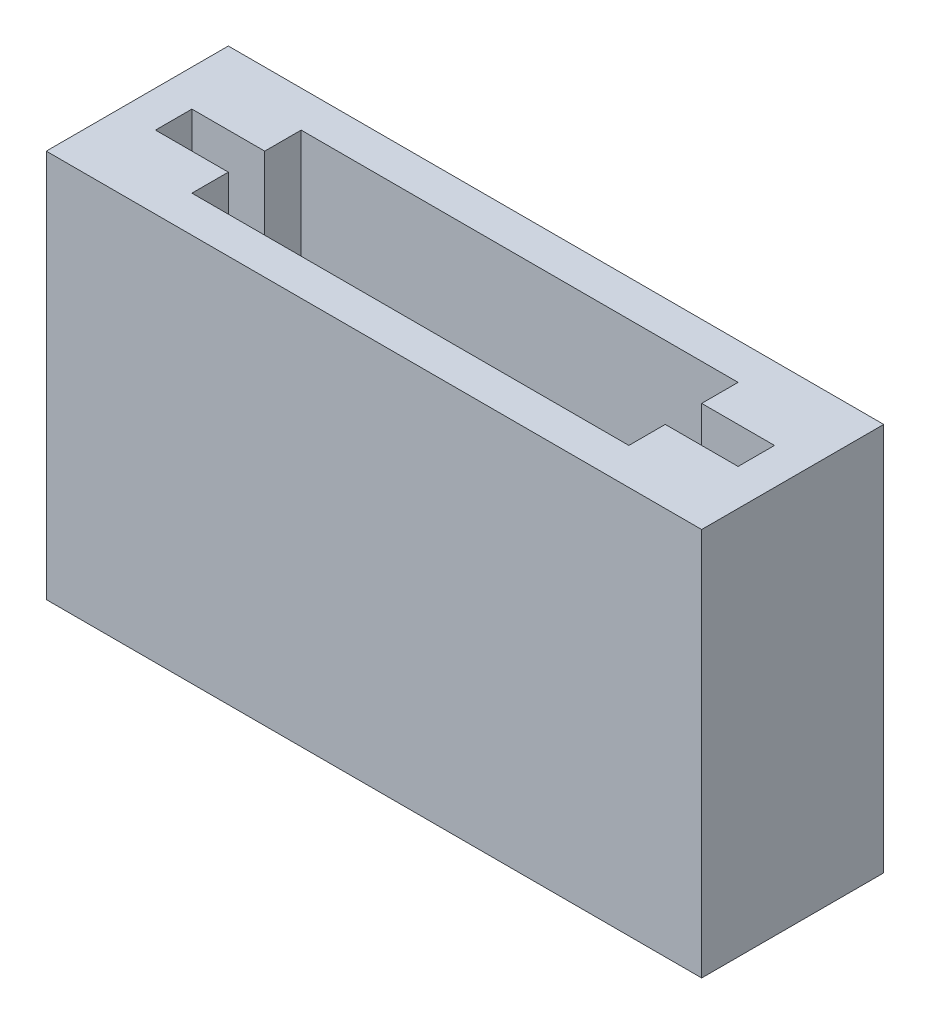
ISO-10303-21;
HEADER;
FILE_DESCRIPTION(('STEP AP214'),'2;1');
FILE_NAME('part.step','',(''),(''),'','','');
FILE_SCHEMA(('AUTOMOTIVE_DESIGN { 1 0 10303 214 1 1 1 1 }'));
ENDSEC;
DATA;
#1=APPLICATION_CONTEXT('core data for automotive mechanical design processes');
#2=APPLICATION_PROTOCOL_DEFINITION('international standard','automotive_design',2000,#1);
#3=PRODUCT_CONTEXT('',#1,'mechanical');
#4=PRODUCT('Part','Part','',(#3));
#5=PRODUCT_RELATED_PRODUCT_CATEGORY('part','',(#4));
#6=PRODUCT_DEFINITION_FORMATION('','',#4);
#7=PRODUCT_DEFINITION_CONTEXT('part definition',#1,'design');
#8=PRODUCT_DEFINITION('design','',#6,#7);
#9=PRODUCT_DEFINITION_SHAPE('','',#8);
#10=(LENGTH_UNIT() NAMED_UNIT(*) SI_UNIT(.MILLI.,.METRE.));
#11=(NAMED_UNIT(*) PLANE_ANGLE_UNIT() SI_UNIT($,.RADIAN.));
#12=(NAMED_UNIT(*) SI_UNIT($,.STERADIAN.) SOLID_ANGLE_UNIT());
#13=UNCERTAINTY_MEASURE_WITH_UNIT(LENGTH_MEASURE(1.E-05),#10,'distance_accuracy_value','');
#14=(GEOMETRIC_REPRESENTATION_CONTEXT(3) GLOBAL_UNCERTAINTY_ASSIGNED_CONTEXT((#13)) GLOBAL_UNIT_ASSIGNED_CONTEXT((#10,
#11,#12)) REPRESENTATION_CONTEXT('',''));
#15=CARTESIAN_POINT('',(0.,0.,0.));
#16=DIRECTION('',(0.,0.,1.));
#17=DIRECTION('',(1.,0.,0.));
#18=AXIS2_PLACEMENT_3D('',#15,#16,#17);
#19=CARTESIAN_POINT('',(28.575,-16.9333333333333,-7.9475));
#20=DIRECTION('',(0.,1.,0.));
#21=DIRECTION('',(-1.,0.,0.));
#22=AXIS2_PLACEMENT_3D('',#19,#20,#21);
#23=PLANE('',#22);
#24=DIRECTION('',(-1.,0.,0.));
#25=VECTOR('',#24,1.);
#26=CARTESIAN_POINT('',(0.,-16.9333333333334,-1.5875));
#27=LINE('',#26,#25);
#28=CARTESIAN_POINT('',(-19.05,-16.9333333333334,-1.5875));
#29=VERTEX_POINT('',#28);
#30=CARTESIAN_POINT('',(-25.4,-16.9333333333334,-1.5875));
#31=VERTEX_POINT('',#30);
#32=EDGE_CURVE('E212',#29,#31,#27,.T.);
#33=ORIENTED_EDGE('',*,*,#32,.T.);
#34=DIRECTION('',(0.,0.,-1.));
#35=VECTOR('',#34,1.);
#36=CARTESIAN_POINT('',(-25.4,-16.9333333333334,0.));
#37=LINE('',#36,#35);
#38=CARTESIAN_POINT('',(-25.4,-16.9333333333334,1.5875));
#39=VERTEX_POINT('',#38);
#40=EDGE_CURVE('E160',#39,#31,#37,.T.);
#41=ORIENTED_EDGE('',*,*,#40,.F.);
#42=DIRECTION('',(-1.,0.,0.));
#43=VECTOR('',#42,1.);
#44=CARTESIAN_POINT('',(0.,-16.9333333333334,1.5875));
#45=LINE('',#44,#43);
#46=CARTESIAN_POINT('',(-19.05,-16.9333333333334,1.5875));
#47=VERTEX_POINT('',#46);
#48=EDGE_CURVE('E157',#47,#39,#45,.T.);
#49=ORIENTED_EDGE('',*,*,#48,.F.);
#50=DIRECTION('',(0.,0.,-1.));
#51=VECTOR('',#50,1.);
#52=CARTESIAN_POINT('',(-19.05,-16.9333333333334,0.));
#53=LINE('',#52,#51);
#54=CARTESIAN_POINT('',(-19.05,-16.9333333333334,4.7625));
#55=VERTEX_POINT('',#54);
#56=EDGE_CURVE('E148',#55,#47,#53,.T.);
#57=ORIENTED_EDGE('',*,*,#56,.F.);
#58=DIRECTION('',(-1.,0.,0.));
#59=VECTOR('',#58,1.);
#60=CARTESIAN_POINT('',(0.,-16.9333333333334,4.7625));
#61=LINE('',#60,#59);
#62=CARTESIAN_POINT('',(19.05,-16.9333333333334,4.7625));
#63=VERTEX_POINT('',#62);
#64=EDGE_CURVE('E153',#63,#55,#61,.T.);
#65=ORIENTED_EDGE('',*,*,#64,.F.);
#66=DIRECTION('',(0.,0.,-1.));
#67=VECTOR('',#66,1.);
#68=CARTESIAN_POINT('',(19.05,-16.9333333333333,0.));
#69=LINE('',#68,#67);
#70=CARTESIAN_POINT('',(19.05,-16.9333333333333,1.5875));
#71=VERTEX_POINT('',#70);
#72=EDGE_CURVE('E205',#63,#71,#69,.T.);
#73=ORIENTED_EDGE('',*,*,#72,.T.);
#74=CARTESIAN_POINT('',(25.4,-16.9333333333333,1.5875));
#75=VERTEX_POINT('',#74);
#76=EDGE_CURVE('E163',#75,#71,#45,.T.);
#77=ORIENTED_EDGE('',*,*,#76,.F.);
#78=DIRECTION('',(0.,0.,-1.));
#79=VECTOR('',#78,1.);
#80=CARTESIAN_POINT('',(25.4,-16.9333333333333,0.));
#81=LINE('',#80,#79);
#82=CARTESIAN_POINT('',(25.4,-16.9333333333333,-1.5875));
#83=VERTEX_POINT('',#82);
#84=EDGE_CURVE('E207',#75,#83,#81,.T.);
#85=ORIENTED_EDGE('',*,*,#84,.T.);
#86=CARTESIAN_POINT('',(19.05,-16.9333333333333,-1.5875));
#87=VERTEX_POINT('',#86);
#88=EDGE_CURVE('E215',#83,#87,#27,.T.);
#89=ORIENTED_EDGE('',*,*,#88,.T.);
#90=DIRECTION('',(0.,0.,-1.));
#91=VECTOR('',#90,1.);
#92=CARTESIAN_POINT('',(19.05,-16.9333333333333,0.));
#93=LINE('',#92,#91);
#94=CARTESIAN_POINT('',(19.05,-16.9333333333333,-4.7625));
#95=VERTEX_POINT('',#94);
#96=EDGE_CURVE('E211',#87,#95,#93,.T.);
#97=ORIENTED_EDGE('',*,*,#96,.T.);
#98=DIRECTION('',(-1.,0.,0.));
#99=VECTOR('',#98,1.);
#100=CARTESIAN_POINT('',(0.,-16.9333333333334,-4.7625));
#101=LINE('',#100,#99);
#102=CARTESIAN_POINT('',(-19.05,-16.9333333333334,-4.7625));
#103=VERTEX_POINT('',#102);
#104=EDGE_CURVE('E220',#95,#103,#101,.T.);
#105=ORIENTED_EDGE('',*,*,#104,.T.);
#106=DIRECTION('',(0.,0.,-1.));
#107=VECTOR('',#106,1.);
#108=CARTESIAN_POINT('',(-19.05,-16.9333333333334,0.));
#109=LINE('',#108,#107);
#110=EDGE_CURVE('E223',#29,#103,#109,.T.);
#111=ORIENTED_EDGE('',*,*,#110,.F.);
#112=EDGE_LOOP('',(#33,#41,#49,#57,#65,#73,#77,#85,#89,#97,#105,#111));
#113=FACE_BOUND('',#112,.T.);
#114=DIRECTION('',(0.,0.,-1.));
#115=VECTOR('',#114,1.);
#116=CARTESIAN_POINT('',(28.575,-16.9333333333333,-7.9375));
#117=LINE('',#116,#115);
#118=CARTESIAN_POINT('',(28.575,-16.9333333333334,7.9375));
#119=VERTEX_POINT('',#118);
#120=CARTESIAN_POINT('',(28.575,-16.9333333333334,-7.9375));
#121=VERTEX_POINT('',#120);
#122=EDGE_CURVE('E197',#119,#121,#117,.T.);
#123=ORIENTED_EDGE('',*,*,#122,.F.);
#124=DIRECTION('',(1.,0.,0.));
#125=VECTOR('',#124,1.);
#126=CARTESIAN_POINT('',(-28.575,-16.9333333333334,7.9375));
#127=LINE('',#126,#125);
#128=CARTESIAN_POINT('',(-28.575,-16.9333333333334,7.9375));
#129=VERTEX_POINT('',#128);
#130=EDGE_CURVE('E185',#129,#119,#127,.T.);
#131=ORIENTED_EDGE('',*,*,#130,.F.);
#132=DIRECTION('',(0.,0.,1.));
#133=VECTOR('',#132,1.);
#134=CARTESIAN_POINT('',(-28.575,-16.9333333333334,-7.9375));
#135=LINE('',#134,#133);
#136=CARTESIAN_POINT('',(-28.575,-16.9333333333334,-7.9375));
#137=VERTEX_POINT('',#136);
#138=EDGE_CURVE('E187',#137,#129,#135,.T.);
#139=ORIENTED_EDGE('',*,*,#138,.F.);
#140=DIRECTION('',(-1.,0.,0.));
#141=VECTOR('',#140,1.);
#142=CARTESIAN_POINT('',(-28.575,-16.9333333333334,-7.9375));
#143=LINE('',#142,#141);
#144=EDGE_CURVE('E194',#121,#137,#143,.T.);
#145=ORIENTED_EDGE('',*,*,#144,.F.);
#146=EDGE_LOOP('',(#123,#131,#139,#145));
#147=FACE_BOUND('',#146,.T.);
#148=ADVANCED_FACE('F34',(#113,#147),#23,.F.);
#149=CARTESIAN_POINT('',(28.575,16.9333333333333,-7.9475));
#150=DIRECTION('',(0.,1.,0.));
#151=DIRECTION('',(-1.,0.,0.));
#152=AXIS2_PLACEMENT_3D('',#149,#150,#151);
#153=PLANE('',#152);
#154=DIRECTION('',(0.,0.,-1.));
#155=VECTOR('',#154,1.);
#156=CARTESIAN_POINT('',(28.575,16.9333333333333,-7.9375));
#157=LINE('',#156,#155);
#158=CARTESIAN_POINT('',(28.575,16.9333333333333,7.9375));
#159=VERTEX_POINT('',#158);
#160=CARTESIAN_POINT('',(28.575,16.9333333333333,-7.9375));
#161=VERTEX_POINT('',#160);
#162=EDGE_CURVE('E200',#159,#161,#157,.T.);
#163=ORIENTED_EDGE('',*,*,#162,.T.);
#164=DIRECTION('',(-1.,0.,0.));
#165=VECTOR('',#164,1.);
#166=CARTESIAN_POINT('',(-28.575,16.9333333333333,-7.9375));
#167=LINE('',#166,#165);
#168=CARTESIAN_POINT('',(-28.575,16.9333333333333,-7.9375));
#169=VERTEX_POINT('',#168);
#170=EDGE_CURVE('E37',#161,#169,#167,.T.);
#171=ORIENTED_EDGE('',*,*,#170,.T.);
#172=DIRECTION('',(0.,0.,1.));
#173=VECTOR('',#172,1.);
#174=CARTESIAN_POINT('',(-28.575,16.9333333333333,-7.9375));
#175=LINE('',#174,#173);
#176=CARTESIAN_POINT('',(-28.575,16.9333333333333,7.9375));
#177=VERTEX_POINT('',#176);
#178=EDGE_CURVE('E192',#169,#177,#175,.T.);
#179=ORIENTED_EDGE('',*,*,#178,.T.);
#180=DIRECTION('',(1.,0.,0.));
#181=VECTOR('',#180,1.);
#182=CARTESIAN_POINT('',(-28.575,16.9333333333333,7.9375));
#183=LINE('',#182,#181);
#184=EDGE_CURVE('E188',#177,#159,#183,.T.);
#185=ORIENTED_EDGE('',*,*,#184,.T.);
#186=EDGE_LOOP('',(#163,#171,#179,#185));
#187=FACE_BOUND('',#186,.T.);
#188=DIRECTION('',(-1.,0.,0.));
#189=VECTOR('',#188,1.);
#190=CARTESIAN_POINT('',(0.,16.9333333333333,-1.5875));
#191=LINE('',#190,#189);
#192=CARTESIAN_POINT('',(-19.05,16.9333333333333,-1.5875));
#193=VERTEX_POINT('',#192);
#194=CARTESIAN_POINT('',(-25.4,16.9333333333333,-1.5875));
#195=VERTEX_POINT('',#194);
#196=EDGE_CURVE('E225',#193,#195,#191,.T.);
#197=ORIENTED_EDGE('',*,*,#196,.F.);
#198=DIRECTION('',(0.,0.,-1.));
#199=VECTOR('',#198,1.);
#200=CARTESIAN_POINT('',(-19.05,16.9333333333333,0.));
#201=LINE('',#200,#199);
#202=CARTESIAN_POINT('',(-19.05,16.9333333333333,-4.7625));
#203=VERTEX_POINT('',#202);
#204=EDGE_CURVE('E214',#193,#203,#201,.T.);
#205=ORIENTED_EDGE('',*,*,#204,.T.);
#206=DIRECTION('',(-1.,0.,0.));
#207=VECTOR('',#206,1.);
#208=CARTESIAN_POINT('',(0.,16.9333333333333,-4.7625));
#209=LINE('',#208,#207);
#210=CARTESIAN_POINT('',(19.05,16.9333333333333,-4.7625));
#211=VERTEX_POINT('',#210);
#212=EDGE_CURVE('E226',#211,#203,#209,.T.);
#213=ORIENTED_EDGE('',*,*,#212,.F.);
#214=DIRECTION('',(0.,0.,-1.));
#215=VECTOR('',#214,1.);
#216=CARTESIAN_POINT('',(19.05,16.9333333333333,0.));
#217=LINE('',#216,#215);
#218=CARTESIAN_POINT('',(19.05,16.9333333333333,-1.5875));
#219=VERTEX_POINT('',#218);
#220=EDGE_CURVE('E234',#219,#211,#217,.T.);
#221=ORIENTED_EDGE('',*,*,#220,.F.);
#222=CARTESIAN_POINT('',(25.4,16.9333333333333,-1.5875));
#223=VERTEX_POINT('',#222);
#224=EDGE_CURVE('E217',#223,#219,#191,.T.);
#225=ORIENTED_EDGE('',*,*,#224,.F.);
#226=DIRECTION('',(0.,0.,-1.));
#227=VECTOR('',#226,1.);
#228=CARTESIAN_POINT('',(25.4,16.9333333333333,0.));
#229=LINE('',#228,#227);
#230=CARTESIAN_POINT('',(25.4,16.9333333333333,1.5875));
#231=VERTEX_POINT('',#230);
#232=EDGE_CURVE('E230',#231,#223,#229,.T.);
#233=ORIENTED_EDGE('',*,*,#232,.F.);
#234=DIRECTION('',(-1.,0.,0.));
#235=VECTOR('',#234,1.);
#236=CARTESIAN_POINT('',(0.,16.9333333333333,1.5875));
#237=LINE('',#236,#235);
#238=CARTESIAN_POINT('',(19.05,16.9333333333333,1.5875));
#239=VERTEX_POINT('',#238);
#240=EDGE_CURVE('E191',#231,#239,#237,.T.);
#241=ORIENTED_EDGE('',*,*,#240,.T.);
#242=DIRECTION('',(0.,0.,-1.));
#243=VECTOR('',#242,1.);
#244=CARTESIAN_POINT('',(19.05,16.9333333333333,0.));
#245=LINE('',#244,#243);
#246=CARTESIAN_POINT('',(19.05,16.9333333333333,4.7625));
#247=VERTEX_POINT('',#246);
#248=EDGE_CURVE('E204',#247,#239,#245,.T.);
#249=ORIENTED_EDGE('',*,*,#248,.F.);
#250=DIRECTION('',(-1.,0.,0.));
#251=VECTOR('',#250,1.);
#252=CARTESIAN_POINT('',(0.,16.9333333333333,4.7625));
#253=LINE('',#252,#251);
#254=CARTESIAN_POINT('',(-19.05,16.9333333333333,4.7625));
#255=VERTEX_POINT('',#254);
#256=EDGE_CURVE('E42',#247,#255,#253,.T.);
#257=ORIENTED_EDGE('',*,*,#256,.T.);
#258=DIRECTION('',(0.,0.,-1.));
#259=VECTOR('',#258,1.);
#260=CARTESIAN_POINT('',(-19.05,16.9333333333333,0.));
#261=LINE('',#260,#259);
#262=CARTESIAN_POINT('',(-19.05,16.9333333333333,1.5875));
#263=VERTEX_POINT('',#262);
#264=EDGE_CURVE('E12',#255,#263,#261,.T.);
#265=ORIENTED_EDGE('',*,*,#264,.T.);
#266=CARTESIAN_POINT('',(-25.4,16.9333333333333,1.5875));
#267=VERTEX_POINT('',#266);
#268=EDGE_CURVE('E167',#263,#267,#237,.T.);
#269=ORIENTED_EDGE('',*,*,#268,.T.);
#270=DIRECTION('',(0.,0.,-1.));
#271=VECTOR('',#270,1.);
#272=CARTESIAN_POINT('',(-25.4,16.9333333333333,0.));
#273=LINE('',#272,#271);
#274=EDGE_CURVE('E232',#267,#195,#273,.T.);
#275=ORIENTED_EDGE('',*,*,#274,.T.);
#276=EDGE_LOOP('',(#197,#205,#213,#221,#225,#233,#241,#249,#257,#265,#269,#275));
#277=FACE_BOUND('',#276,.T.);
#278=ADVANCED_FACE('F246',(#187,#277),#153,.T.);
#279=CARTESIAN_POINT('',(-25.4,-102.485255392617,0.));
#280=DIRECTION('',(-1.,0.,0.));
#281=DIRECTION('',(0.,0.,1.));
#282=AXIS2_PLACEMENT_3D('',#279,#280,#281);
#283=PLANE('',#282);
#284=ORIENTED_EDGE('',*,*,#274,.F.);
#285=DIRECTION('',(0.,1.,0.));
#286=VECTOR('',#285,1.);
#287=CARTESIAN_POINT('',(-25.4,-102.485255392617,1.5875));
#288=LINE('',#287,#286);
#289=EDGE_CURVE('E177',#39,#267,#288,.T.);
#290=ORIENTED_EDGE('',*,*,#289,.F.);
#291=ORIENTED_EDGE('',*,*,#40,.T.);
#292=DIRECTION('',(0.,1.,0.));
#293=VECTOR('',#292,1.);
#294=CARTESIAN_POINT('',(-25.4,-102.485255392617,-1.5875));
#295=LINE('',#294,#293);
#296=EDGE_CURVE('E257',#31,#195,#295,.T.);
#297=ORIENTED_EDGE('',*,*,#296,.T.);
#298=EDGE_LOOP('',(#284,#290,#291,#297));
#299=FACE_BOUND('',#298,.T.);
#300=ADVANCED_FACE('F296',(#299),#283,.F.);
#301=CARTESIAN_POINT('',(0.,-102.485255392617,-1.5875));
#302=DIRECTION('',(0.,0.,1.));
#303=DIRECTION('',(1.,0.,0.));
#304=AXIS2_PLACEMENT_3D('',#301,#302,#303);
#305=PLANE('',#304);
#306=DIRECTION('',(0.,1.,0.));
#307=VECTOR('',#306,1.);
#308=CARTESIAN_POINT('',(-19.05,-102.485255392617,-1.5875));
#309=LINE('',#308,#307);
#310=EDGE_CURVE('E254',#29,#193,#309,.T.);
#311=ORIENTED_EDGE('',*,*,#310,.T.);
#312=ORIENTED_EDGE('',*,*,#196,.T.);
#313=ORIENTED_EDGE('',*,*,#296,.F.);
#314=ORIENTED_EDGE('',*,*,#32,.F.);
#315=EDGE_LOOP('',(#311,#312,#313,#314));
#316=FACE_BOUND('',#315,.T.);
#317=ADVANCED_FACE('F302',(#316),#305,.T.);
#318=CARTESIAN_POINT('',(-19.05,-102.485255392617,0.));
#319=DIRECTION('',(-1.,0.,0.));
#320=DIRECTION('',(0.,0.,1.));
#321=AXIS2_PLACEMENT_3D('',#318,#319,#320);
#322=PLANE('',#321);
#323=ORIENTED_EDGE('',*,*,#204,.F.);
#324=ORIENTED_EDGE('',*,*,#310,.F.);
#325=ORIENTED_EDGE('',*,*,#110,.T.);
#326=DIRECTION('',(0.,1.,0.));
#327=VECTOR('',#326,1.);
#328=CARTESIAN_POINT('',(-19.05,-102.485255392617,-4.7625));
#329=LINE('',#328,#327);
#330=EDGE_CURVE('E251',#103,#203,#329,.T.);
#331=ORIENTED_EDGE('',*,*,#330,.T.);
#332=EDGE_LOOP('',(#323,#324,#325,#331));
#333=FACE_BOUND('',#332,.T.);
#334=ADVANCED_FACE('F252',(#333),#322,.F.);
#335=CARTESIAN_POINT('',(0.,-102.485255392617,-4.7625));
#336=DIRECTION('',(0.,0.,1.));
#337=DIRECTION('',(1.,0.,0.));
#338=AXIS2_PLACEMENT_3D('',#335,#336,#337);
#339=PLANE('',#338);
#340=DIRECTION('',(0.,1.,0.));
#341=VECTOR('',#340,1.);
#342=CARTESIAN_POINT('',(19.05,-102.485255392617,-4.7625));
#343=LINE('',#342,#341);
#344=EDGE_CURVE('E255',#95,#211,#343,.T.);
#345=ORIENTED_EDGE('',*,*,#344,.T.);
#346=ORIENTED_EDGE('',*,*,#212,.T.);
#347=ORIENTED_EDGE('',*,*,#330,.F.);
#348=ORIENTED_EDGE('',*,*,#104,.F.);
#349=EDGE_LOOP('',(#345,#346,#347,#348));
#350=FACE_BOUND('',#349,.T.);
#351=ADVANCED_FACE('F407',(#350),#339,.T.);
#352=DIRECTION('',(0.,1.,0.));
#353=VECTOR('',#352,1.);
#354=CARTESIAN_POINT('',(25.4,-102.485255392617,-1.5875));
#355=LINE('',#354,#353);
#356=EDGE_CURVE('E265',#83,#223,#355,.T.);
#357=ORIENTED_EDGE('',*,*,#356,.T.);
#358=ORIENTED_EDGE('',*,*,#224,.T.);
#359=DIRECTION('',(0.,1.,0.));
#360=VECTOR('',#359,1.);
#361=CARTESIAN_POINT('',(19.05,-102.485255392617,-1.5875));
#362=LINE('',#361,#360);
#363=EDGE_CURVE('E259',#87,#219,#362,.T.);
#364=ORIENTED_EDGE('',*,*,#363,.F.);
#365=ORIENTED_EDGE('',*,*,#88,.F.);
#366=EDGE_LOOP('',(#357,#358,#364,#365));
#367=FACE_BOUND('',#366,.T.);
#368=ADVANCED_FACE('F399',(#367),#305,.T.);
#369=CARTESIAN_POINT('',(0.,-102.485255392617,1.5875));
#370=DIRECTION('',(0.,0.,1.));
#371=DIRECTION('',(1.,0.,0.));
#372=AXIS2_PLACEMENT_3D('',#369,#370,#371);
#373=PLANE('',#372);
#374=ORIENTED_EDGE('',*,*,#240,.F.);
#375=DIRECTION('',(0.,1.,0.));
#376=VECTOR('',#375,1.);
#377=CARTESIAN_POINT('',(25.4,-102.485255392617,1.5875));
#378=LINE('',#377,#376);
#379=EDGE_CURVE('E268',#75,#231,#378,.T.);
#380=ORIENTED_EDGE('',*,*,#379,.F.);
#381=ORIENTED_EDGE('',*,*,#76,.T.);
#382=DIRECTION('',(0.,1.,0.));
#383=VECTOR('',#382,1.);
#384=CARTESIAN_POINT('',(19.05,-102.485255392617,1.5875));
#385=LINE('',#384,#383);
#386=EDGE_CURVE('E271',#71,#239,#385,.T.);
#387=ORIENTED_EDGE('',*,*,#386,.T.);
#388=EDGE_LOOP('',(#374,#380,#381,#387));
#389=FACE_BOUND('',#388,.T.);
#390=ADVANCED_FACE('F290',(#389),#373,.F.);
#391=CARTESIAN_POINT('',(19.05,-102.485255392617,0.));
#392=DIRECTION('',(-1.,0.,0.));
#393=DIRECTION('',(0.,0.,1.));
#394=AXIS2_PLACEMENT_3D('',#391,#392,#393);
#395=PLANE('',#394);
#396=DIRECTION('',(0.,1.,0.));
#397=VECTOR('',#396,1.);
#398=CARTESIAN_POINT('',(19.05,-102.485255392617,4.7625));
#399=LINE('',#398,#397);
#400=EDGE_CURVE('E169',#63,#247,#399,.T.);
#401=ORIENTED_EDGE('',*,*,#400,.T.);
#402=ORIENTED_EDGE('',*,*,#248,.T.);
#403=ORIENTED_EDGE('',*,*,#386,.F.);
#404=ORIENTED_EDGE('',*,*,#72,.F.);
#405=EDGE_LOOP('',(#401,#402,#403,#404));
#406=FACE_BOUND('',#405,.T.);
#407=ADVANCED_FACE('F276',(#406),#395,.T.);
#408=ORIENTED_EDGE('',*,*,#268,.F.);
#409=DIRECTION('',(0.,1.,0.));
#410=VECTOR('',#409,1.);
#411=CARTESIAN_POINT('',(-19.05,-102.485255392617,1.5875));
#412=LINE('',#411,#410);
#413=EDGE_CURVE('E50',#47,#263,#412,.T.);
#414=ORIENTED_EDGE('',*,*,#413,.F.);
#415=ORIENTED_EDGE('',*,*,#48,.T.);
#416=ORIENTED_EDGE('',*,*,#289,.T.);
#417=EDGE_LOOP('',(#408,#414,#415,#416));
#418=FACE_BOUND('',#417,.T.);
#419=ADVANCED_FACE('F165',(#418),#373,.F.);
#420=CARTESIAN_POINT('',(0.,-102.485255392617,4.7625));
#421=DIRECTION('',(0.,0.,1.));
#422=DIRECTION('',(1.,0.,0.));
#423=AXIS2_PLACEMENT_3D('',#420,#421,#422);
#424=PLANE('',#423);
#425=ORIENTED_EDGE('',*,*,#256,.F.);
#426=ORIENTED_EDGE('',*,*,#400,.F.);
#427=ORIENTED_EDGE('',*,*,#64,.T.);
#428=DIRECTION('',(0.,1.,0.));
#429=VECTOR('',#428,1.);
#430=CARTESIAN_POINT('',(-19.05,-102.485255392617,4.7625));
#431=LINE('',#430,#429);
#432=EDGE_CURVE('E58',#55,#255,#431,.T.);
#433=ORIENTED_EDGE('',*,*,#432,.T.);
#434=EDGE_LOOP('',(#425,#426,#427,#433));
#435=FACE_BOUND('',#434,.T.);
#436=ADVANCED_FACE('F280',(#435),#424,.F.);
#437=CARTESIAN_POINT('',(-19.05,-102.485255392617,0.));
#438=DIRECTION('',(-1.,0.,0.));
#439=DIRECTION('',(0.,0.,1.));
#440=AXIS2_PLACEMENT_3D('',#437,#438,#439);
#441=PLANE('',#440);
#442=ORIENTED_EDGE('',*,*,#264,.F.);
#443=ORIENTED_EDGE('',*,*,#432,.F.);
#444=ORIENTED_EDGE('',*,*,#56,.T.);
#445=ORIENTED_EDGE('',*,*,#413,.T.);
#446=EDGE_LOOP('',(#442,#443,#444,#445));
#447=FACE_BOUND('',#446,.T.);
#448=ADVANCED_FACE('F150',(#447),#441,.F.);
#449=CARTESIAN_POINT('',(25.4,-102.485255392617,0.));
#450=DIRECTION('',(-1.,0.,0.));
#451=DIRECTION('',(0.,0.,1.));
#452=AXIS2_PLACEMENT_3D('',#449,#450,#451);
#453=PLANE('',#452);
#454=ORIENTED_EDGE('',*,*,#379,.T.);
#455=ORIENTED_EDGE('',*,*,#232,.T.);
#456=ORIENTED_EDGE('',*,*,#356,.F.);
#457=ORIENTED_EDGE('',*,*,#84,.F.);
#458=EDGE_LOOP('',(#454,#455,#456,#457));
#459=FACE_BOUND('',#458,.T.);
#460=ADVANCED_FACE('F287',(#459),#453,.T.);
#461=CARTESIAN_POINT('',(19.05,-102.485255392617,0.));
#462=DIRECTION('',(-1.,0.,0.));
#463=DIRECTION('',(0.,0.,1.));
#464=AXIS2_PLACEMENT_3D('',#461,#462,#463);
#465=PLANE('',#464);
#466=ORIENTED_EDGE('',*,*,#363,.T.);
#467=ORIENTED_EDGE('',*,*,#220,.T.);
#468=ORIENTED_EDGE('',*,*,#344,.F.);
#469=ORIENTED_EDGE('',*,*,#96,.F.);
#470=EDGE_LOOP('',(#466,#467,#468,#469));
#471=FACE_BOUND('',#470,.T.);
#472=ADVANCED_FACE('F320',(#471),#465,.T.);
#473=CARTESIAN_POINT('',(-28.575,50.8,-7.9375));
#474=DIRECTION('',(0.,0.,1.));
#475=DIRECTION('',(1.,0.,0.));
#476=AXIS2_PLACEMENT_3D('',#473,#474,#475);
#477=PLANE('',#476);
#478=ORIENTED_EDGE('',*,*,#170,.F.);
#479=DIRECTION('',(0.,-1.,0.));
#480=VECTOR('',#479,1.);
#481=CARTESIAN_POINT('',(28.575,50.8,-7.9375));
#482=LINE('',#481,#480);
#483=EDGE_CURVE('E154',#161,#121,#482,.T.);
#484=ORIENTED_EDGE('',*,*,#483,.T.);
#485=ORIENTED_EDGE('',*,*,#144,.T.);
#486=DIRECTION('',(0.,-1.,0.));
#487=VECTOR('',#486,1.);
#488=CARTESIAN_POINT('',(-28.575,50.8,-7.9375));
#489=LINE('',#488,#487);
#490=EDGE_CURVE('E180',#169,#137,#489,.T.);
#491=ORIENTED_EDGE('',*,*,#490,.F.);
#492=EDGE_LOOP('',(#478,#484,#485,#491));
#493=FACE_BOUND('',#492,.T.);
#494=ADVANCED_FACE('F318',(#493),#477,.F.);
#495=CARTESIAN_POINT('',(28.575,50.8,-7.9375));
#496=DIRECTION('',(-1.,0.,0.));
#497=DIRECTION('',(0.,0.,1.));
#498=AXIS2_PLACEMENT_3D('',#495,#496,#497);
#499=PLANE('',#498);
#500=ORIENTED_EDGE('',*,*,#162,.F.);
#501=DIRECTION('',(0.,-1.,0.));
#502=VECTOR('',#501,1.);
#503=CARTESIAN_POINT('',(28.575,50.8,7.9375));
#504=LINE('',#503,#502);
#505=EDGE_CURVE('E173',#159,#119,#504,.T.);
#506=ORIENTED_EDGE('',*,*,#505,.T.);
#507=ORIENTED_EDGE('',*,*,#122,.T.);
#508=ORIENTED_EDGE('',*,*,#483,.F.);
#509=EDGE_LOOP('',(#500,#506,#507,#508));
#510=FACE_BOUND('',#509,.T.);
#511=ADVANCED_FACE('F313',(#510),#499,.F.);
#512=CARTESIAN_POINT('',(-28.575,50.8,-7.9375));
#513=DIRECTION('',(1.,0.,0.));
#514=DIRECTION('',(0.,0.,-1.));
#515=AXIS2_PLACEMENT_3D('',#512,#513,#514);
#516=PLANE('',#515);
#517=ORIENTED_EDGE('',*,*,#178,.F.);
#518=ORIENTED_EDGE('',*,*,#490,.T.);
#519=ORIENTED_EDGE('',*,*,#138,.T.);
#520=DIRECTION('',(0.,-1.,0.));
#521=VECTOR('',#520,1.);
#522=CARTESIAN_POINT('',(-28.575,50.8,7.9375));
#523=LINE('',#522,#521);
#524=EDGE_CURVE('E176',#177,#129,#523,.T.);
#525=ORIENTED_EDGE('',*,*,#524,.F.);
#526=EDGE_LOOP('',(#517,#518,#519,#525));
#527=FACE_BOUND('',#526,.T.);
#528=ADVANCED_FACE('F307',(#527),#516,.F.);
#529=CARTESIAN_POINT('',(-28.575,50.8,7.9375));
#530=DIRECTION('',(0.,0.,-1.));
#531=DIRECTION('',(-1.,0.,0.));
#532=AXIS2_PLACEMENT_3D('',#529,#530,#531);
#533=PLANE('',#532);
#534=ORIENTED_EDGE('',*,*,#184,.F.);
#535=ORIENTED_EDGE('',*,*,#524,.T.);
#536=ORIENTED_EDGE('',*,*,#130,.T.);
#537=ORIENTED_EDGE('',*,*,#505,.F.);
#538=EDGE_LOOP('',(#534,#535,#536,#537));
#539=FACE_BOUND('',#538,.T.);
#540=ADVANCED_FACE('F298',(#539),#533,.F.);
#541=CLOSED_SHELL('',(#148,#278,#300,#317,#334,#351,#368,#390,#407,#419,#436,#448,#460,#472,
#494,#511,#528,#540));
#542=MANIFOLD_SOLID_BREP('B2',#541);
#543=ADVANCED_BREP_SHAPE_REPRESENTATION('',(#18,#542),#14);
#544=SHAPE_DEFINITION_REPRESENTATION(#9,#543);
ENDSEC;
END-ISO-10303-21;
